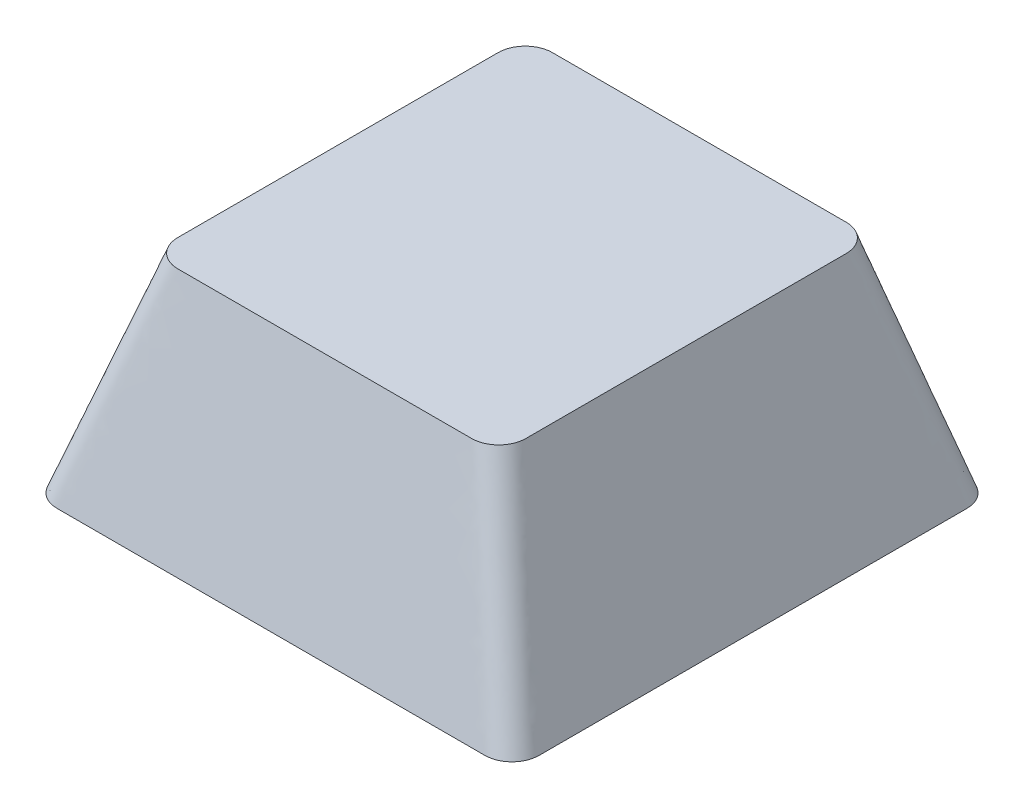
ISO-10303-21;
HEADER;
FILE_DESCRIPTION(('STEP AP214'),'2;1');
FILE_NAME('part.step','',(''),(''),'','','');
FILE_SCHEMA(('AUTOMOTIVE_DESIGN { 1 0 10303 214 1 1 1 1 }'));
ENDSEC;
DATA;
#1=APPLICATION_CONTEXT('core data for automotive mechanical design processes');
#2=APPLICATION_PROTOCOL_DEFINITION('international standard','automotive_design',2000,#1);
#3=PRODUCT_CONTEXT('',#1,'mechanical');
#4=PRODUCT('Part','Part','',(#3));
#5=PRODUCT_RELATED_PRODUCT_CATEGORY('part','',(#4));
#6=PRODUCT_DEFINITION_FORMATION('','',#4);
#7=PRODUCT_DEFINITION_CONTEXT('part definition',#1,'design');
#8=PRODUCT_DEFINITION('design','',#6,#7);
#9=PRODUCT_DEFINITION_SHAPE('','',#8);
#10=(LENGTH_UNIT() NAMED_UNIT(*) SI_UNIT(.MILLI.,.METRE.));
#11=(NAMED_UNIT(*) PLANE_ANGLE_UNIT() SI_UNIT($,.RADIAN.));
#12=(NAMED_UNIT(*) SI_UNIT($,.STERADIAN.) SOLID_ANGLE_UNIT());
#13=UNCERTAINTY_MEASURE_WITH_UNIT(LENGTH_MEASURE(1.E-05),#10,'distance_accuracy_value','');
#14=(GEOMETRIC_REPRESENTATION_CONTEXT(3) GLOBAL_UNCERTAINTY_ASSIGNED_CONTEXT((#13)) GLOBAL_UNIT_ASSIGNED_CONTEXT((#10,
#11,#12)) REPRESENTATION_CONTEXT('',''));
#15=CARTESIAN_POINT('',(0.,0.,0.));
#16=DIRECTION('',(0.,0.,1.));
#17=DIRECTION('',(1.,0.,0.));
#18=AXIS2_PLACEMENT_3D('',#15,#16,#17);
#19=CARTESIAN_POINT('',(-7.9883,0.,-7.9883));
#20=DIRECTION('',(0.,-1.,0.));
#21=DIRECTION('',(0.,0.,-1.));
#22=AXIS2_PLACEMENT_3D('',#19,#20,#21);
#23=PLANE('',#22);
#24=CARTESIAN_POINT('',(-7.9883,0.,-7.9883));
#25=DIRECTION('',(0.,1.,0.));
#26=DIRECTION('',(0.,0.,-1.));
#27=AXIS2_PLACEMENT_3D('',#24,#25,#26);
#28=CIRCLE('',#27,1.016);
#29=CARTESIAN_POINT('',(-7.98829999990609,0.,-9.0043));
#30=VERTEX_POINT('',#29);
#31=CARTESIAN_POINT('',(-9.0043,0.,-7.9883));
#32=VERTEX_POINT('',#31);
#33=EDGE_CURVE('E307',#30,#32,#28,.T.);
#34=ORIENTED_EDGE('',*,*,#33,.F.);
#35=DIRECTION('',(-1.,0.,0.));
#36=VECTOR('',#35,1.);
#37=CARTESIAN_POINT('',(-7.9883,0.,-9.0043));
#38=LINE('',#37,#36);
#39=CARTESIAN_POINT('',(7.98829999996438,0.,-9.0043));
#40=VERTEX_POINT('',#39);
#41=EDGE_CURVE('E539',#40,#30,#38,.T.);
#42=ORIENTED_EDGE('',*,*,#41,.F.);
#43=CARTESIAN_POINT('',(7.9883,0.,-7.9883));
#44=DIRECTION('',(0.,1.,0.));
#45=DIRECTION('',(0.,0.,-1.));
#46=AXIS2_PLACEMENT_3D('',#43,#44,#45);
#47=CIRCLE('',#46,1.016);
#48=CARTESIAN_POINT('',(9.0043,0.,-7.98829999983761));
#49=VERTEX_POINT('',#48);
#50=EDGE_CURVE('E530',#49,#40,#47,.T.);
#51=ORIENTED_EDGE('',*,*,#50,.F.);
#52=DIRECTION('',(0.,0.,-1.));
#53=VECTOR('',#52,1.);
#54=CARTESIAN_POINT('',(9.0043,0.,7.9883));
#55=LINE('',#54,#53);
#56=CARTESIAN_POINT('',(9.0043,0.,7.98829999999821));
#57=VERTEX_POINT('',#56);
#58=EDGE_CURVE('E521',#57,#49,#55,.T.);
#59=ORIENTED_EDGE('',*,*,#58,.F.);
#60=CARTESIAN_POINT('',(7.9883,0.,7.9883));
#61=DIRECTION('',(0.,1.,0.));
#62=DIRECTION('',(0.,0.,1.));
#63=AXIS2_PLACEMENT_3D('',#60,#61,#62);
#64=CIRCLE('',#63,1.016);
#65=CARTESIAN_POINT('',(7.98829999990616,0.,9.0043));
#66=VERTEX_POINT('',#65);
#67=EDGE_CURVE('E512',#66,#57,#64,.T.);
#68=ORIENTED_EDGE('',*,*,#67,.F.);
#69=DIRECTION('',(1.,0.,0.));
#70=VECTOR('',#69,1.);
#71=CARTESIAN_POINT('',(-7.9883,0.,9.0043));
#72=LINE('',#71,#70);
#73=CARTESIAN_POINT('',(-7.98829999996438,0.,9.0043));
#74=VERTEX_POINT('',#73);
#75=EDGE_CURVE('E506',#74,#66,#72,.T.);
#76=ORIENTED_EDGE('',*,*,#75,.F.);
#77=CARTESIAN_POINT('',(-7.9883,0.,7.9883));
#78=DIRECTION('',(0.,1.,0.));
#79=DIRECTION('',(0.,0.,-1.));
#80=AXIS2_PLACEMENT_3D('',#77,#78,#79);
#81=CIRCLE('',#80,1.016);
#82=CARTESIAN_POINT('',(-9.0043,0.,7.9883));
#83=VERTEX_POINT('',#82);
#84=EDGE_CURVE('E240',#83,#74,#81,.T.);
#85=ORIENTED_EDGE('',*,*,#84,.F.);
#86=DIRECTION('',(0.,0.,1.));
#87=VECTOR('',#86,1.);
#88=CARTESIAN_POINT('',(-9.0043,0.,7.9883));
#89=LINE('',#88,#87);
#90=EDGE_CURVE('E12',#32,#83,#89,.T.);
#91=ORIENTED_EDGE('',*,*,#90,.F.);
#92=EDGE_LOOP('',(#34,#42,#51,#59,#68,#76,#85,#91));
#93=FACE_BOUND('',#92,.T.);
#94=ADVANCED_FACE('F230',(#93),#23,.T.);
#95=CARTESIAN_POINT('',(5.4864,8.001,-5.9817));
#96=DIRECTION('',(0.,-1.,0.));
#97=DIRECTION('',(0.,0.,-1.));
#98=AXIS2_PLACEMENT_3D('',#95,#96,#97);
#99=PLANE('',#98);
#100=CARTESIAN_POINT('',(5.4864,8.001,-5.9817));
#101=DIRECTION('',(0.,1.,0.));
#102=DIRECTION('',(0.,0.,-1.));
#103=AXIS2_PLACEMENT_3D('',#100,#101,#102);
#104=CIRCLE('',#103,1.016);
#105=CARTESIAN_POINT('',(6.5024,8.001,-5.9817));
#106=VERTEX_POINT('',#105);
#107=CARTESIAN_POINT('',(5.4864,8.001,-6.9977));
#108=VERTEX_POINT('',#107);
#109=EDGE_CURVE('E303',#106,#108,#104,.T.);
#110=ORIENTED_EDGE('',*,*,#109,.T.);
#111=DIRECTION('',(-1.,0.,0.));
#112=VECTOR('',#111,1.);
#113=CARTESIAN_POINT('',(-5.4864,8.001,-6.9977));
#114=LINE('',#113,#112);
#115=CARTESIAN_POINT('',(-5.4864,8.001,-6.9977));
#116=VERTEX_POINT('',#115);
#117=EDGE_CURVE('E295',#108,#116,#114,.T.);
#118=ORIENTED_EDGE('',*,*,#117,.T.);
#119=CARTESIAN_POINT('',(-5.4864,8.001,-5.9817));
#120=DIRECTION('',(0.,1.,0.));
#121=DIRECTION('',(0.,0.,-1.));
#122=AXIS2_PLACEMENT_3D('',#119,#120,#121);
#123=CIRCLE('',#122,1.016);
#124=CARTESIAN_POINT('',(-6.5024,8.001,-5.9817));
#125=VERTEX_POINT('',#124);
#126=EDGE_CURVE('E299',#116,#125,#123,.T.);
#127=ORIENTED_EDGE('',*,*,#126,.T.);
#128=DIRECTION('',(0.,0.,1.));
#129=VECTOR('',#128,1.);
#130=CARTESIAN_POINT('',(-6.5024,8.001,5.9817));
#131=LINE('',#130,#129);
#132=CARTESIAN_POINT('',(-6.5024,8.001,5.9817));
#133=VERTEX_POINT('',#132);
#134=EDGE_CURVE('E314',#125,#133,#131,.T.);
#135=ORIENTED_EDGE('',*,*,#134,.T.);
#136=CARTESIAN_POINT('',(-5.4864,8.001,5.9817));
#137=DIRECTION('',(0.,1.,0.));
#138=DIRECTION('',(0.,0.,-1.));
#139=AXIS2_PLACEMENT_3D('',#136,#137,#138);
#140=CIRCLE('',#139,1.016);
#141=CARTESIAN_POINT('',(-5.4864,8.001,6.9977));
#142=VERTEX_POINT('',#141);
#143=EDGE_CURVE('E438',#133,#142,#140,.T.);
#144=ORIENTED_EDGE('',*,*,#143,.T.);
#145=DIRECTION('',(1.,0.,0.));
#146=VECTOR('',#145,1.);
#147=CARTESIAN_POINT('',(-5.4864,8.001,6.9977));
#148=LINE('',#147,#146);
#149=CARTESIAN_POINT('',(5.4864,8.001,6.9977));
#150=VERTEX_POINT('',#149);
#151=EDGE_CURVE('E455',#142,#150,#148,.T.);
#152=ORIENTED_EDGE('',*,*,#151,.T.);
#153=CARTESIAN_POINT('',(5.4864,8.001,5.9817));
#154=DIRECTION('',(0.,1.,0.));
#155=DIRECTION('',(0.,0.,1.));
#156=AXIS2_PLACEMENT_3D('',#153,#154,#155);
#157=CIRCLE('',#156,1.016);
#158=CARTESIAN_POINT('',(6.5024,8.001,5.9817));
#159=VERTEX_POINT('',#158);
#160=EDGE_CURVE('E458',#150,#159,#157,.T.);
#161=ORIENTED_EDGE('',*,*,#160,.T.);
#162=DIRECTION('',(0.,0.,-1.));
#163=VECTOR('',#162,1.);
#164=CARTESIAN_POINT('',(6.5024,8.001,5.9817));
#165=LINE('',#164,#163);
#166=EDGE_CURVE('E476',#159,#106,#165,.T.);
#167=ORIENTED_EDGE('',*,*,#166,.T.);
#168=EDGE_LOOP('',(#110,#118,#127,#135,#144,#152,#161,#167));
#169=FACE_BOUND('',#168,.T.);
#170=ADVANCED_FACE('F298',(#169),#99,.F.);
#171=CARTESIAN_POINT('',(-5.48639999934055,8.001,-6.9977));
#172=CARTESIAN_POINT('',(-7.988299999078,0.,-9.0043));
#173=CARTESIAN_POINT('',(-4.55269900004469,8.001,-6.9977));
#174=CARTESIAN_POINT('',(-6.68287859472045,0.,-9.0043));
#175=CARTESIAN_POINT('',(-2.71513340645196,8.00099999999999,-6.99769999999999));
#176=CARTESIAN_POINT('',(-4.03423998005595,0.,-9.00430000000001));
#177=CARTESIAN_POINT('',(0.,8.001,-6.99770000000001));
#178=CARTESIAN_POINT('',(0.,0.,-9.0043));
#179=CARTESIAN_POINT('',(2.71513340645196,8.001,-6.99769999999999));
#180=CARTESIAN_POINT('',(4.03423998005596,0.,-9.0043));
#181=CARTESIAN_POINT('',(4.55269900004469,8.001,-6.9977));
#182=CARTESIAN_POINT('',(6.68287859472045,0.,-9.0043));
#183=CARTESIAN_POINT('',(5.6000930883069,8.001,-6.9977));
#184=CARTESIAN_POINT('',(8.14725601602148,0.,-9.0043));
#185=CARTESIAN_POINT('',(5.84844592115599,8.001,-6.95980645515603));
#186=CARTESIAN_POINT('',(8.41694964227491,0.,-8.93519685916861));
#187=CARTESIAN_POINT('',(6.22009209733794,8.001,-6.7310435516542));
#188=CARTESIAN_POINT('',(8.72750998802735,0.,-8.71834644794475));
#189=CARTESIAN_POINT('',(6.4611928725801,8.00099999999999,-6.35773052097646));
#190=CARTESIAN_POINT('',(8.93935295126113,0.,-8.40678885107173));
#191=CARTESIAN_POINT('',(6.5024,8.001,-6.09979007677237));
#192=CARTESIAN_POINT('',(9.0043,0.,-8.14134159197827));
#193=CARTESIAN_POINT('',(6.5024,8.001,-4.96984598853877));
#194=CARTESIAN_POINT('',(9.0043,0.,-6.67696417063875));
#195=CARTESIAN_POINT('',(6.5024,8.00099999999999,-2.96898099464874));
#196=CARTESIAN_POINT('',(9.0043,0.,-4.02490202012947));
#197=CARTESIAN_POINT('',(6.5024,8.001,0.));
#198=CARTESIAN_POINT('',(9.0043,0.,0.));
#199=CARTESIAN_POINT('',(6.5024,8.001,2.96898099464875));
#200=CARTESIAN_POINT('',(9.0043,0.,4.02490202012947));
#201=CARTESIAN_POINT('',(6.5024,8.001,4.96984598853877));
#202=CARTESIAN_POINT('',(9.0043,0.,6.67696417063875));
#203=CARTESIAN_POINT('',(6.5024,8.001,6.09979007677237));
#204=CARTESIAN_POINT('',(9.0043,0.,8.14134159197827));
#205=CARTESIAN_POINT('',(6.46119287258011,8.00099999999999,6.35773052097646));
#206=CARTESIAN_POINT('',(8.93935295126112,0.,8.40678885107173));
#207=CARTESIAN_POINT('',(6.22009209733794,8.00100000000001,6.7310435516542));
#208=CARTESIAN_POINT('',(8.72750998802737,0.,8.71834644794475));
#209=CARTESIAN_POINT('',(5.84844592115599,8.00099999999999,6.95980645515602));
#210=CARTESIAN_POINT('',(8.4169496422749,0.,8.93519685916861));
#211=CARTESIAN_POINT('',(5.6000930883069,8.001,6.9977));
#212=CARTESIAN_POINT('',(8.14725601602149,0.,9.0043));
#213=CARTESIAN_POINT('',(4.55269900004469,8.001,6.9977));
#214=CARTESIAN_POINT('',(6.68287859472045,0.,9.0043));
#215=CARTESIAN_POINT('',(2.71513340645196,8.00099999999999,6.99769999999999));
#216=CARTESIAN_POINT('',(4.03423998005596,0.,9.00429999999999));
#217=CARTESIAN_POINT('',(0.,8.001,6.99770000000001));
#218=CARTESIAN_POINT('',(0.,0.,9.0043));
#219=CARTESIAN_POINT('',(-2.71513340645196,8.001,6.99769999999999));
#220=CARTESIAN_POINT('',(-4.03423998005595,0.,9.0043));
#221=CARTESIAN_POINT('',(-4.55269900004469,8.001,6.9977));
#222=CARTESIAN_POINT('',(-6.68287859472045,0.,9.0043));
#223=CARTESIAN_POINT('',(-5.60009308830691,8.001,6.9977));
#224=CARTESIAN_POINT('',(-8.14725601602148,0.,9.0043));
#225=CARTESIAN_POINT('',(-5.848445921156,8.00100000000001,6.95980645515603));
#226=CARTESIAN_POINT('',(-8.41694964227491,0.,8.93519685916862));
#227=CARTESIAN_POINT('',(-6.22009209733794,8.001,6.7310435516542));
#228=CARTESIAN_POINT('',(-8.72750998802735,0.,8.71834644794474));
#229=CARTESIAN_POINT('',(-6.46119287258011,8.001,6.35773052097646));
#230=CARTESIAN_POINT('',(-8.93935295126114,0.,8.40678885107173));
#231=CARTESIAN_POINT('',(-6.5024,8.001,6.09979007677237));
#232=CARTESIAN_POINT('',(-9.0043,0.,8.14134159197827));
#233=CARTESIAN_POINT('',(-6.5024,8.001,4.96984598853876));
#234=CARTESIAN_POINT('',(-9.0043,0.,6.67696417063875));
#235=CARTESIAN_POINT('',(-6.50240000000001,8.001,2.96898099464874));
#236=CARTESIAN_POINT('',(-9.0043,0.,4.02490202012947));
#237=CARTESIAN_POINT('',(-6.5024,8.00099999999999,0.));
#238=CARTESIAN_POINT('',(-9.0043,0.,0.));
#239=CARTESIAN_POINT('',(-6.5024,8.001,-2.96898099464874));
#240=CARTESIAN_POINT('',(-9.00430000000001,0.,-4.02490202012947));
#241=CARTESIAN_POINT('',(-6.5024,8.001,-4.96984598853876));
#242=CARTESIAN_POINT('',(-9.0043,0.,-6.67696417063876));
#243=CARTESIAN_POINT('',(-6.5024,8.001,-6.09979007677237));
#244=CARTESIAN_POINT('',(-9.0043,0.,-8.14134159197828));
#245=CARTESIAN_POINT('',(-6.46119287258011,8.00100000000001,-6.35773052097647));
#246=CARTESIAN_POINT('',(-8.93935295126112,0.,-8.40678885107173));
#247=CARTESIAN_POINT('',(-6.22009209733795,8.001,-6.7310435516542));
#248=CARTESIAN_POINT('',(-8.72750998802736,0.,-8.71834644794475));
#249=CARTESIAN_POINT('',(-5.84844592115599,8.001,-6.95980645515603));
#250=CARTESIAN_POINT('',(-8.4169496422749,0.,-8.93519685916861));
#251=CARTESIAN_POINT('',(-5.60009308830691,8.001,-6.9977));
#252=CARTESIAN_POINT('',(-8.14725601602148,0.,-9.0043));
#253=CARTESIAN_POINT('',(-5.48639999934055,8.001,-6.9977));
#254=CARTESIAN_POINT('',(-7.988299999078,0.,-9.0043));
#255=B_SPLINE_SURFACE_WITH_KNOTS('',3,1,((#171,#172),(#173,#174),(#175,#176),(#177,#178),(#179,
#180),(#181,#182),(#183,#184),(#185,#186),(#187,#188),(#189,#190),(#191,#192),(#193,#194),(#195,
#196),(#197,#198),(#199,#200),(#201,#202),(#203,#204),(#205,#206),(#207,#208),(#209,#210),(#211,
#212),(#213,#214),(#215,#216),(#217,#218),(#219,#220),(#221,#222),(#223,#224),(#225,#226),(#227,
#228),(#229,#230),(#231,#232),(#233,#234),(#235,#236),(#237,#238),(#239,#240),(#241,#242),(#243,
#244),(#245,#246),(#247,#248),(#249,#250),(#251,#252),(#253,#254)),.UNSPECIFIED.,.T.,.F.,.F.,(4,
1,1,1,2,1,1,1,2,1,1,1,2,1,1,1,2,1,1,1,2,1,1,1,2,1,1,1,2,1,1,1,4),(2,2),(0.,0.0546595344764767,
0.109319068952953,0.16397860342943,0.218638137905907,0.225293813888668,0.23194948987143,
0.238605165854192,0.245260841836954,0.302289955394953,0.359319068952953,0.416348182510953,
0.473377296068953,0.480032972051715,0.486688648034477,0.493344324017238,0.5,0.554659534476477,
0.609319068952953,0.66397860342943,0.718638137905907,0.725293813888668,0.73194948987143,
0.738605165854192,0.745260841836954,0.802289955394954,0.859319068952953,0.916348182510953,
0.973377296068953,0.980032972051715,0.986688648034477,0.993344324017238,1.),(0.,1.),.UNSPECIFIED.);
#256=ORIENTED_EDGE('',*,*,#109,.F.);
#257=ORIENTED_EDGE('',*,*,#166,.F.);
#258=ORIENTED_EDGE('',*,*,#160,.F.);
#259=ORIENTED_EDGE('',*,*,#151,.F.);
#260=ORIENTED_EDGE('',*,*,#143,.F.);
#261=ORIENTED_EDGE('',*,*,#134,.F.);
#262=ORIENTED_EDGE('',*,*,#126,.F.);
#263=ORIENTED_EDGE('',*,*,#117,.F.);
#264=EDGE_LOOP('',(#256,#257,#258,#259,#260,#261,#262,#263));
#265=FACE_BOUND('',#264,.T.);
#266=ORIENTED_EDGE('',*,*,#90,.T.);
#267=ORIENTED_EDGE('',*,*,#84,.T.);
#268=ORIENTED_EDGE('',*,*,#75,.T.);
#269=ORIENTED_EDGE('',*,*,#67,.T.);
#270=ORIENTED_EDGE('',*,*,#58,.T.);
#271=ORIENTED_EDGE('',*,*,#50,.T.);
#272=ORIENTED_EDGE('',*,*,#41,.T.);
#273=ORIENTED_EDGE('',*,*,#33,.T.);
#274=EDGE_LOOP('',(#266,#267,#268,#269,#270,#271,#272,#273));
#275=FACE_BOUND('',#274,.T.);
#276=ADVANCED_FACE('F312',(#265,#275),#255,.T.);
#277=CLOSED_SHELL('',(#94,#170,#276));
#278=MANIFOLD_SOLID_BREP('B2',#277);
#279=ADVANCED_BREP_SHAPE_REPRESENTATION('',(#18,#278),#14);
#280=SHAPE_DEFINITION_REPRESENTATION(#9,#279);
ENDSEC;
END-ISO-10303-21;
